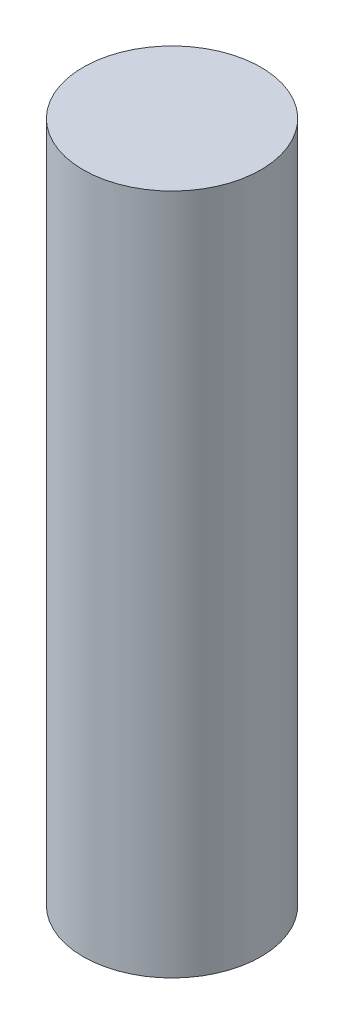
ISO-10303-21;
HEADER;
FILE_DESCRIPTION(('STEP AP214'),'2;1');
FILE_NAME('part.step','',(''),(''),'','','');
FILE_SCHEMA(('AUTOMOTIVE_DESIGN { 1 0 10303 214 1 1 1 1 }'));
ENDSEC;
DATA;
#1=APPLICATION_CONTEXT('core data for automotive mechanical design processes');
#2=APPLICATION_PROTOCOL_DEFINITION('international standard','automotive_design',2000,#1);
#3=PRODUCT_CONTEXT('',#1,'mechanical');
#4=PRODUCT('Part','Part','',(#3));
#5=PRODUCT_RELATED_PRODUCT_CATEGORY('part','',(#4));
#6=PRODUCT_DEFINITION_FORMATION('','',#4);
#7=PRODUCT_DEFINITION_CONTEXT('part definition',#1,'design');
#8=PRODUCT_DEFINITION('design','',#6,#7);
#9=PRODUCT_DEFINITION_SHAPE('','',#8);
#10=(LENGTH_UNIT() NAMED_UNIT(*) SI_UNIT(.MILLI.,.METRE.));
#11=(NAMED_UNIT(*) PLANE_ANGLE_UNIT() SI_UNIT($,.RADIAN.));
#12=(NAMED_UNIT(*) SI_UNIT($,.STERADIAN.) SOLID_ANGLE_UNIT());
#13=UNCERTAINTY_MEASURE_WITH_UNIT(LENGTH_MEASURE(1.E-05),#10,'distance_accuracy_value','');
#14=(GEOMETRIC_REPRESENTATION_CONTEXT(3) GLOBAL_UNCERTAINTY_ASSIGNED_CONTEXT((#13)) GLOBAL_UNIT_ASSIGNED_CONTEXT((#10,
#11,#12)) REPRESENTATION_CONTEXT('',''));
#15=CARTESIAN_POINT('',(0.,0.,0.));
#16=DIRECTION('',(0.,0.,1.));
#17=DIRECTION('',(1.,0.,0.));
#18=AXIS2_PLACEMENT_3D('',#15,#16,#17);
#19=CARTESIAN_POINT('',(0.,69.,0.));
#20=DIRECTION('',(0.,-1.,0.));
#21=DIRECTION('',(0.,0.,-1.));
#22=AXIS2_PLACEMENT_3D('',#19,#20,#21);
#23=CYLINDRICAL_SURFACE('',#22,9.);
#24=CARTESIAN_POINT('',(0.,69.,0.));
#25=DIRECTION('',(0.,1.,0.));
#26=DIRECTION('',(0.,0.,1.));
#27=AXIS2_PLACEMENT_3D('',#24,#25,#26);
#28=CIRCLE('',#27,9.);
#29=CARTESIAN_POINT('',(0.,69.,9.));
#30=VERTEX_POINT('',#29);
#31=EDGE_CURVE('E10',#30,#30,#28,.T.);
#32=ORIENTED_EDGE('',*,*,#31,.F.);
#33=EDGE_LOOP('',(#32));
#34=FACE_BOUND('',#33,.T.);
#35=CARTESIAN_POINT('',(0.,0.,0.));
#36=DIRECTION('',(0.,1.,0.));
#37=DIRECTION('',(0.,0.,1.));
#38=AXIS2_PLACEMENT_3D('',#35,#36,#37);
#39=CIRCLE('',#38,9.);
#40=CARTESIAN_POINT('',(0.,0.,9.));
#41=VERTEX_POINT('',#40);
#42=EDGE_CURVE('E40',#41,#41,#39,.T.);
#43=ORIENTED_EDGE('',*,*,#42,.T.);
#44=EDGE_LOOP('',(#43));
#45=FACE_BOUND('',#44,.T.);
#46=ADVANCED_FACE('F37',(#34,#45),#23,.T.);
#47=CARTESIAN_POINT('',(0.,69.,0.));
#48=DIRECTION('',(0.,1.,0.));
#49=DIRECTION('',(0.,0.,1.));
#50=AXIS2_PLACEMENT_3D('',#47,#48,#49);
#51=PLANE('',#50);
#52=ORIENTED_EDGE('',*,*,#31,.T.);
#53=EDGE_LOOP('',(#52));
#54=FACE_BOUND('',#53,.T.);
#55=ADVANCED_FACE('F54',(#54),#51,.T.);
#56=CARTESIAN_POINT('',(0.,0.,0.));
#57=DIRECTION('',(0.,1.,0.));
#58=DIRECTION('',(0.,0.,1.));
#59=AXIS2_PLACEMENT_3D('',#56,#57,#58);
#60=PLANE('',#59);
#61=ORIENTED_EDGE('',*,*,#42,.F.);
#62=EDGE_LOOP('',(#61));
#63=FACE_BOUND('',#62,.T.);
#64=ADVANCED_FACE('F52',(#63),#60,.F.);
#65=CLOSED_SHELL('',(#46,#55,#64));
#66=MANIFOLD_SOLID_BREP('B2',#65);
#67=ADVANCED_BREP_SHAPE_REPRESENTATION('',(#18,#66),#14);
#68=SHAPE_DEFINITION_REPRESENTATION(#9,#67);
ENDSEC;
END-ISO-10303-21;
